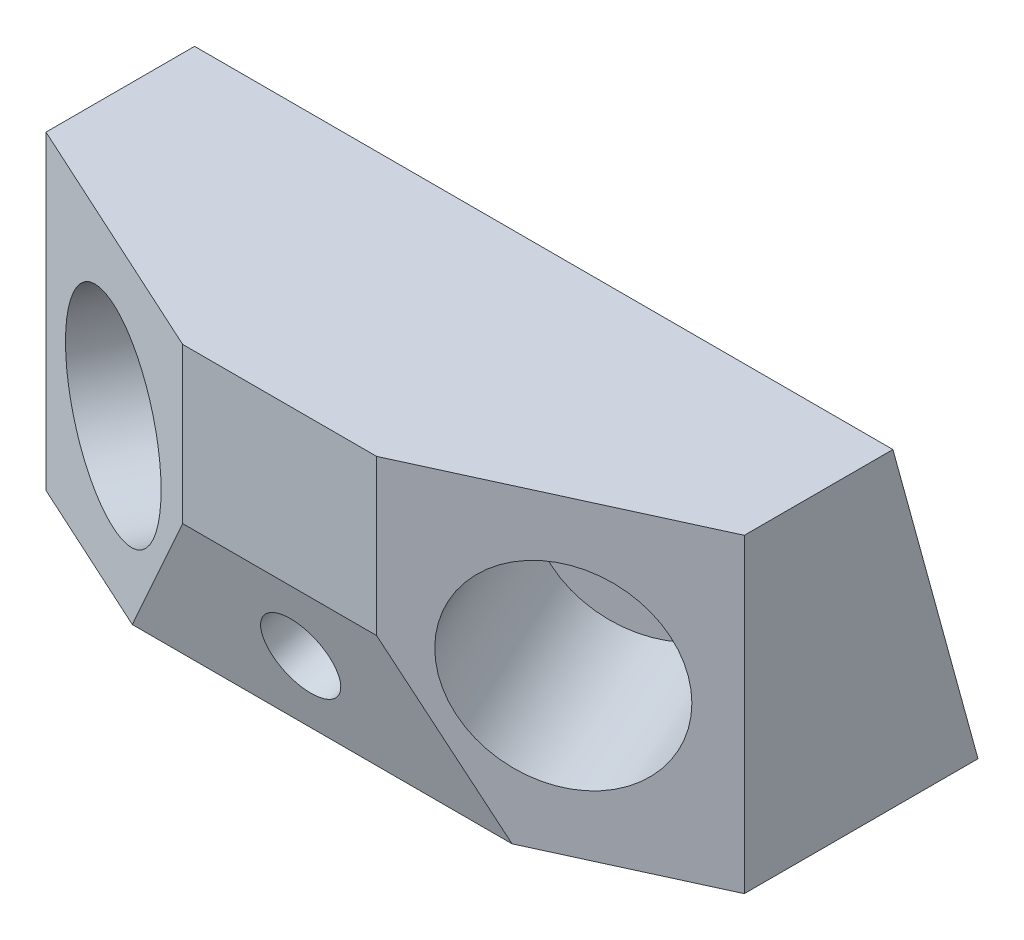
ISO-10303-21;
HEADER;
FILE_DESCRIPTION(('STEP AP214'),'2;1');
FILE_NAME('part.step','',(''),(''),'','','');
FILE_SCHEMA(('AUTOMOTIVE_DESIGN { 1 0 10303 214 1 1 1 1 }'));
ENDSEC;
DATA;
#1=APPLICATION_CONTEXT('core data for automotive mechanical design processes');
#2=APPLICATION_PROTOCOL_DEFINITION('international standard','automotive_design',2000,#1);
#3=PRODUCT_CONTEXT('',#1,'mechanical');
#4=PRODUCT('Part','Part','',(#3));
#5=PRODUCT_RELATED_PRODUCT_CATEGORY('part','',(#4));
#6=PRODUCT_DEFINITION_FORMATION('','',#4);
#7=PRODUCT_DEFINITION_CONTEXT('part definition',#1,'design');
#8=PRODUCT_DEFINITION('design','',#6,#7);
#9=PRODUCT_DEFINITION_SHAPE('','',#8);
#10=(LENGTH_UNIT() NAMED_UNIT(*) SI_UNIT(.MILLI.,.METRE.));
#11=(NAMED_UNIT(*) PLANE_ANGLE_UNIT() SI_UNIT($,.RADIAN.));
#12=(NAMED_UNIT(*) SI_UNIT($,.STERADIAN.) SOLID_ANGLE_UNIT());
#13=UNCERTAINTY_MEASURE_WITH_UNIT(LENGTH_MEASURE(1.E-05),#10,'distance_accuracy_value','');
#14=(GEOMETRIC_REPRESENTATION_CONTEXT(3) GLOBAL_UNCERTAINTY_ASSIGNED_CONTEXT((#13)) GLOBAL_UNIT_ASSIGNED_CONTEXT((#10,
#11,#12)) REPRESENTATION_CONTEXT('',''));
#15=CARTESIAN_POINT('',(0.,0.,0.));
#16=DIRECTION('',(0.,0.,1.));
#17=DIRECTION('',(1.,0.,0.));
#18=AXIS2_PLACEMENT_3D('',#15,#16,#17);
#19=CARTESIAN_POINT('',(-45.,20.,45.));
#20=DIRECTION('',(0.,-1.,0.));
#21=DIRECTION('',(0.,0.,-1.));
#22=AXIS2_PLACEMENT_3D('',#19,#20,#21);
#23=PLANE('',#22);
#24=DIRECTION('',(0.,0.,-1.));
#25=VECTOR('',#24,1.);
#26=CARTESIAN_POINT('',(45.,20.,45.));
#27=LINE('',#26,#25);
#28=CARTESIAN_POINT('',(45.,20.,30.1134763918329));
#29=VERTEX_POINT('',#28);
#30=CARTESIAN_POINT('',(45.,20.,10.9652763471162));
#31=VERTEX_POINT('',#30);
#32=EDGE_CURVE('E140',#29,#31,#27,.T.);
#33=ORIENTED_EDGE('',*,*,#32,.T.);
#34=DIRECTION('',(1.,0.,0.));
#35=VECTOR('',#34,1.);
#36=CARTESIAN_POINT('',(-61.,20.,10.9652763471162));
#37=LINE('',#36,#35);
#38=CARTESIAN_POINT('',(-45.,20.,10.9652763471162));
#39=VERTEX_POINT('',#38);
#40=EDGE_CURVE('E115',#39,#31,#37,.T.);
#41=ORIENTED_EDGE('',*,*,#40,.F.);
#42=DIRECTION('',(0.,0.,-1.));
#43=VECTOR('',#42,1.);
#44=CARTESIAN_POINT('',(-45.,20.,45.));
#45=LINE('',#44,#43);
#46=CARTESIAN_POINT('',(-45.,20.,30.1134763918332));
#47=VERTEX_POINT('',#46);
#48=EDGE_CURVE('E137',#47,#39,#45,.T.);
#49=ORIENTED_EDGE('',*,*,#48,.F.);
#50=DIRECTION('',(-0.909163440494605,0.,-0.41643947755708));
#51=VECTOR('',#50,1.);
#52=CARTESIAN_POINT('',(-39.3637902497896,20.,32.695124684359));
#53=LINE('',#52,#51);
#54=CARTESIAN_POINT('',(-12.5,20.,45.));
#55=VERTEX_POINT('',#54);
#56=EDGE_CURVE('E112',#55,#47,#53,.T.);
#57=ORIENTED_EDGE('',*,*,#56,.F.);
#58=DIRECTION('',(-1.,0.,0.));
#59=VECTOR('',#58,1.);
#60=CARTESIAN_POINT('',(-45.,20.,45.));
#61=LINE('',#60,#59);
#62=CARTESIAN_POINT('',(12.5,20.,45.));
#63=VERTEX_POINT('',#62);
#64=EDGE_CURVE('E128',#63,#55,#61,.T.);
#65=ORIENTED_EDGE('',*,*,#64,.F.);
#66=DIRECTION('',(0.909163440494602,0.,-0.416439477557086));
#67=VECTOR('',#66,1.);
#68=CARTESIAN_POINT('',(-35.0282442880889,20.,66.7701640199806));
#69=LINE('',#68,#67);
#70=EDGE_CURVE('E124',#63,#29,#69,.T.);
#71=ORIENTED_EDGE('',*,*,#70,.T.);
#72=EDGE_LOOP('',(#33,#41,#49,#57,#65,#71));
#73=FACE_BOUND('',#72,.T.);
#74=ADVANCED_FACE('F33',(#73),#23,.F.);
#75=CARTESIAN_POINT('',(-45.,-20.,45.));
#76=DIRECTION('',(1.,0.,0.));
#77=DIRECTION('',(0.,0.,-1.));
#78=AXIS2_PLACEMENT_3D('',#75,#76,#77);
#79=PLANE('',#78);
#80=ORIENTED_EDGE('',*,*,#48,.T.);
#81=DIRECTION('',(0.,-0.964419122638794,-0.264378054854443));
#82=VECTOR('',#81,1.);
#83=CARTESIAN_POINT('',(-45.,-8.52629367315474,3.14530901498783));
#84=LINE('',#83,#82);
#85=CARTESIAN_POINT('',(-45.,-20.,0.));
#86=VERTEX_POINT('',#85);
#87=EDGE_CURVE('E110',#39,#86,#84,.T.);
#88=ORIENTED_EDGE('',*,*,#87,.T.);
#89=DIRECTION('',(0.,0.,-1.));
#90=VECTOR('',#89,1.);
#91=CARTESIAN_POINT('',(-45.,-20.,45.));
#92=LINE('',#91,#90);
#93=CARTESIAN_POINT('',(-45.,-20.,30.1134763918332));
#94=VERTEX_POINT('',#93);
#95=EDGE_CURVE('E135',#94,#86,#92,.T.);
#96=ORIENTED_EDGE('',*,*,#95,.F.);
#97=DIRECTION('',(0.,-1.,0.));
#98=VECTOR('',#97,1.);
#99=CARTESIAN_POINT('',(-45.,25.,30.1134763918332));
#100=LINE('',#99,#98);
#101=EDGE_CURVE('E108',#47,#94,#100,.T.);
#102=ORIENTED_EDGE('',*,*,#101,.F.);
#103=EDGE_LOOP('',(#80,#88,#96,#102));
#104=FACE_BOUND('',#103,.T.);
#105=ADVANCED_FACE('F157',(#104),#79,.F.);
#106=CARTESIAN_POINT('',(-45.,-20.,45.));
#107=DIRECTION('',(0.,1.,0.));
#108=DIRECTION('',(0.,0.,1.));
#109=AXIS2_PLACEMENT_3D('',#106,#107,#108);
#110=PLANE('',#109);
#111=DIRECTION('',(0.909163440494602,0.,-0.416439477557086));
#112=VECTOR('',#111,1.);
#113=CARTESIAN_POINT('',(19.2052926486611,-20.,41.9286616211088));
#114=LINE('',#113,#112);
#115=CARTESIAN_POINT('',(24.4696005145808,-20.,39.5173618264419));
#116=VERTEX_POINT('',#115);
#117=CARTESIAN_POINT('',(45.,-20.,30.1134763918329));
#118=VERTEX_POINT('',#117);
#119=EDGE_CURVE('E103',#116,#118,#114,.T.);
#120=ORIENTED_EDGE('',*,*,#119,.F.);
#121=DIRECTION('',(1.,0.,0.));
#122=VECTOR('',#121,1.);
#123=CARTESIAN_POINT('',(-61.,-20.,39.5173618264419));
#124=LINE('',#123,#122);
#125=CARTESIAN_POINT('',(-24.4696005145812,-20.,39.5173618264419));
#126=VERTEX_POINT('',#125);
#127=EDGE_CURVE('E91',#126,#116,#124,.T.);
#128=ORIENTED_EDGE('',*,*,#127,.F.);
#129=DIRECTION('',(-0.909163440494605,0.,-0.41643947755708));
#130=VECTOR('',#129,1.);
#131=CARTESIAN_POINT('',(-19.2052926486608,-20.,41.928661621109));
#132=LINE('',#131,#130);
#133=EDGE_CURVE('E100',#126,#94,#132,.T.);
#134=ORIENTED_EDGE('',*,*,#133,.T.);
#135=ORIENTED_EDGE('',*,*,#95,.T.);
#136=DIRECTION('',(1.,0.,0.));
#137=VECTOR('',#136,1.);
#138=CARTESIAN_POINT('',(-45.,-20.,0.));
#139=LINE('',#138,#137);
#140=CARTESIAN_POINT('',(45.,-20.,0.));
#141=VERTEX_POINT('',#140);
#142=EDGE_CURVE('E127',#86,#141,#139,.T.);
#143=ORIENTED_EDGE('',*,*,#142,.T.);
#144=DIRECTION('',(0.,0.,-1.));
#145=VECTOR('',#144,1.);
#146=CARTESIAN_POINT('',(45.,-20.,45.));
#147=LINE('',#146,#145);
#148=EDGE_CURVE('E130',#118,#141,#147,.T.);
#149=ORIENTED_EDGE('',*,*,#148,.F.);
#150=EDGE_LOOP('',(#120,#128,#134,#135,#143,#149));
#151=FACE_BOUND('',#150,.T.);
#152=ADVANCED_FACE('F98',(#151),#110,.F.);
#153=CARTESIAN_POINT('',(0.,0.,45.));
#154=DIRECTION('',(0.,0.,-1.));
#155=DIRECTION('',(-1.,0.,0.));
#156=AXIS2_PLACEMENT_3D('',#153,#154,#155);
#157=PLANE('',#156);
#158=DIRECTION('',(0.,1.,0.));
#159=VECTOR('',#158,1.);
#160=CARTESIAN_POINT('',(-12.5,0.,45.));
#161=LINE('',#160,#159);
#162=CARTESIAN_POINT('',(-12.5,0.,45.));
#163=VERTEX_POINT('',#162);
#164=EDGE_CURVE('E41',#163,#55,#161,.T.);
#165=ORIENTED_EDGE('',*,*,#164,.F.);
#166=DIRECTION('',(1.,0.,0.));
#167=VECTOR('',#166,1.);
#168=CARTESIAN_POINT('',(-61.,0.,45.));
#169=LINE('',#168,#167);
#170=CARTESIAN_POINT('',(12.5,0.,45.));
#171=VERTEX_POINT('',#170);
#172=EDGE_CURVE('E47',#163,#171,#169,.T.);
#173=ORIENTED_EDGE('',*,*,#172,.T.);
#174=DIRECTION('',(0.,1.,0.));
#175=VECTOR('',#174,1.);
#176=CARTESIAN_POINT('',(12.5,0.,45.));
#177=LINE('',#176,#175);
#178=EDGE_CURVE('E54',#171,#63,#177,.T.);
#179=ORIENTED_EDGE('',*,*,#178,.T.);
#180=ORIENTED_EDGE('',*,*,#64,.T.);
#181=EDGE_LOOP('',(#165,#173,#179,#180));
#182=FACE_BOUND('',#181,.T.);
#183=ADVANCED_FACE('F148',(#182),#157,.F.);
#184=CARTESIAN_POINT('',(45.,-20.,45.));
#185=DIRECTION('',(-1.,0.,0.));
#186=DIRECTION('',(0.,0.,1.));
#187=AXIS2_PLACEMENT_3D('',#184,#185,#186);
#188=PLANE('',#187);
#189=ORIENTED_EDGE('',*,*,#148,.T.);
#190=DIRECTION('',(0.,-0.964419122638794,-0.264378054854442));
#191=VECTOR('',#190,1.);
#192=CARTESIAN_POINT('',(45.,-20.,0.));
#193=LINE('',#192,#191);
#194=EDGE_CURVE('E171',#31,#141,#193,.T.);
#195=ORIENTED_EDGE('',*,*,#194,.F.);
#196=ORIENTED_EDGE('',*,*,#32,.F.);
#197=DIRECTION('',(0.,-1.,0.));
#198=VECTOR('',#197,1.);
#199=CARTESIAN_POINT('',(45.,25.,30.1134763918329));
#200=LINE('',#199,#198);
#201=EDGE_CURVE('E121',#29,#118,#200,.T.);
#202=ORIENTED_EDGE('',*,*,#201,.T.);
#203=EDGE_LOOP('',(#189,#195,#196,#202));
#204=FACE_BOUND('',#203,.T.);
#205=ADVANCED_FACE('F35',(#204),#188,.F.);
#206=CARTESIAN_POINT('',(19.2052926486611,25.,41.9286616211088));
#207=DIRECTION('',(-0.416439477557086,0.,-0.909163440494602));
#208=DIRECTION('',(-0.909163440494602,0.,0.416439477557086));
#209=AXIS2_PLACEMENT_3D('',#206,#207,#208);
#210=PLANE('',#209);
#211=CARTESIAN_POINT('',(28.998723447295,0.,37.4428111968376));
#212=DIRECTION('',(0.416439477557086,0.,0.909163440494602));
#213=DIRECTION('',(0.909163440494602,0.,-0.416439477557086));
#214=AXIS2_PLACEMENT_3D('',#211,#212,#213);
#215=CIRCLE('',#214,12.5);
#216=CARTESIAN_POINT('',(40.3632664534776,0.,32.2373177273741));
#217=VERTEX_POINT('',#216);
#218=EDGE_CURVE('E179',#217,#217,#215,.T.);
#219=ORIENTED_EDGE('',*,*,#218,.F.);
#220=EDGE_LOOP('',(#219));
#221=FACE_BOUND('',#220,.T.);
#222=ORIENTED_EDGE('',*,*,#178,.F.);
#223=DIRECTION('',(0.49989302065529,-0.835271018521193,-0.228974438570552));
#224=VECTOR('',#223,1.);
#225=CARTESIAN_POINT('',(4.08850585463684,14.0547617025591,48.8528586515356));
#226=LINE('',#225,#224);
#227=EDGE_CURVE('E173',#171,#116,#226,.T.);
#228=ORIENTED_EDGE('',*,*,#227,.T.);
#229=ORIENTED_EDGE('',*,*,#119,.T.);
#230=ORIENTED_EDGE('',*,*,#201,.F.);
#231=ORIENTED_EDGE('',*,*,#70,.F.);
#232=EDGE_LOOP('',(#222,#228,#229,#230,#231));
#233=FACE_BOUND('',#232,.T.);
#234=ADVANCED_FACE('F155',(#221,#233),#210,.F.);
#235=CARTESIAN_POINT('',(-19.2052926486608,25.,41.928661621109));
#236=DIRECTION('',(-0.41643947755708,0.,0.909163440494605));
#237=DIRECTION('',(0.909163440494605,0.,0.41643947755708));
#238=AXIS2_PLACEMENT_3D('',#235,#236,#237);
#239=PLANE('',#238);
#240=CARTESIAN_POINT('',(-28.998723447295,0.,37.4428111968376));
#241=DIRECTION('',(0.416439477557086,0.,-0.909163440494602));
#242=DIRECTION('',(-0.909163440494602,0.,-0.416439477557086));
#243=AXIS2_PLACEMENT_3D('',#240,#241,#242);
#244=CIRCLE('',#243,12.5);
#245=CARTESIAN_POINT('',(-40.3632664534776,0.,32.2373177273741));
#246=VERTEX_POINT('',#245);
#247=EDGE_CURVE('E185',#246,#246,#244,.T.);
#248=ORIENTED_EDGE('',*,*,#247,.T.);
#249=EDGE_LOOP('',(#248));
#250=FACE_BOUND('',#249,.T.);
#251=DIRECTION('',(-0.499893020655297,-0.835271018521189,-0.228974438570551));
#252=VECTOR('',#251,1.);
#253=CARTESIAN_POINT('',(-4.08850585463671,14.0547617025591,48.8528586515356));
#254=LINE('',#253,#252);
#255=EDGE_CURVE('E11',#163,#126,#254,.T.);
#256=ORIENTED_EDGE('',*,*,#255,.F.);
#257=ORIENTED_EDGE('',*,*,#164,.T.);
#258=ORIENTED_EDGE('',*,*,#56,.T.);
#259=ORIENTED_EDGE('',*,*,#101,.T.);
#260=ORIENTED_EDGE('',*,*,#133,.F.);
#261=EDGE_LOOP('',(#256,#257,#258,#259,#260));
#262=FACE_BOUND('',#261,.T.);
#263=ADVANCED_FACE('F106',(#250,#262),#239,.T.);
#264=CARTESIAN_POINT('',(-61.,-20.,0.));
#265=DIRECTION('',(0.,-0.264378054854443,0.964419122638794));
#266=DIRECTION('',(0.,-0.964419122638794,-0.264378054854443));
#267=AXIS2_PLACEMENT_3D('',#264,#265,#266);
#268=PLANE('',#267);
#269=CARTESIAN_POINT('',(35.,0.359452438720388,5.58117555666343));
#270=DIRECTION('',(0.,0.264378054854443,-0.964419122638794));
#271=DIRECTION('',(0.,0.964419122638794,0.264378054854443));
#272=AXIS2_PLACEMENT_3D('',#269,#270,#271);
#273=CIRCLE('',#272,2.);
#274=CARTESIAN_POINT('',(35.,2.28829068399798,6.10993166637232));
#275=VERTEX_POINT('',#274);
#276=EDGE_CURVE('E203',#275,#275,#273,.T.);
#277=ORIENTED_EDGE('',*,*,#276,.F.);
#278=EDGE_LOOP('',(#277));
#279=FACE_BOUND('',#278,.T.);
#280=CARTESIAN_POINT('',(-35.,0.0449315548400526,5.49495534644626));
#281=DIRECTION('',(0.,0.264378054854443,-0.964419122638794));
#282=DIRECTION('',(0.,0.964419122638794,0.264378054854443));
#283=AXIS2_PLACEMENT_3D('',#280,#281,#282);
#284=CIRCLE('',#283,2.);
#285=CARTESIAN_POINT('',(-35.,1.97376980011764,6.02371145615514));
#286=VERTEX_POINT('',#285);
#287=EDGE_CURVE('E197',#286,#286,#284,.T.);
#288=ORIENTED_EDGE('',*,*,#287,.F.);
#289=EDGE_LOOP('',(#288));
#290=FACE_BOUND('',#289,.T.);
#291=CARTESIAN_POINT('',(0.,0.202191996780226,5.53806545155484));
#292=DIRECTION('',(0.,-0.264378054854443,0.964419122638794));
#293=DIRECTION('',(0.,-0.964419122638794,-0.264378054854443));
#294=AXIS2_PLACEMENT_3D('',#291,#292,#293);
#295=CIRCLE('',#294,5.);
#296=CARTESIAN_POINT('',(0.,-4.61990361641375,4.21617517728263));
#297=VERTEX_POINT('',#296);
#298=EDGE_CURVE('E188',#297,#297,#295,.T.);
#299=ORIENTED_EDGE('',*,*,#298,.T.);
#300=EDGE_LOOP('',(#299));
#301=FACE_BOUND('',#300,.T.);
#302=ORIENTED_EDGE('',*,*,#40,.T.);
#303=ORIENTED_EDGE('',*,*,#194,.T.);
#304=ORIENTED_EDGE('',*,*,#142,.F.);
#305=ORIENTED_EDGE('',*,*,#87,.F.);
#306=EDGE_LOOP('',(#302,#303,#304,#305));
#307=FACE_BOUND('',#306,.T.);
#308=ADVANCED_FACE('F169',(#279,#290,#301,#307),#268,.F.);
#309=CARTESIAN_POINT('',(-61.,0.,45.));
#310=DIRECTION('',(0.,0.264378054854442,-0.964419122638794));
#311=DIRECTION('',(0.,0.964419122638794,0.264378054854442));
#312=AXIS2_PLACEMENT_3D('',#309,#310,#311);
#313=PLANE('',#312);
#314=CARTESIAN_POINT('',(0.,-9.87359921229266,42.2933314024136));
#315=DIRECTION('',(0.,-0.264378054854442,0.964419122638794));
#316=DIRECTION('',(0.,-0.964419122638794,-0.264378054854442));
#317=AXIS2_PLACEMENT_3D('',#314,#315,#316);
#318=CIRCLE('',#317,5.);
#319=CARTESIAN_POINT('',(0.,-14.6956948254866,40.9714411281414));
#320=VERTEX_POINT('',#319);
#321=EDGE_CURVE('E193',#320,#320,#318,.T.);
#322=ORIENTED_EDGE('',*,*,#321,.F.);
#323=EDGE_LOOP('',(#322));
#324=FACE_BOUND('',#323,.T.);
#325=ORIENTED_EDGE('',*,*,#172,.F.);
#326=ORIENTED_EDGE('',*,*,#255,.T.);
#327=ORIENTED_EDGE('',*,*,#127,.T.);
#328=ORIENTED_EDGE('',*,*,#227,.F.);
#329=EDGE_LOOP('',(#325,#326,#327,#328));
#330=FACE_BOUND('',#329,.T.);
#331=ADVANCED_FACE('F90',(#324,#330),#313,.F.);
#332=CARTESIAN_POINT('',(18.5877365083679,0.,14.7137251844726));
#333=DIRECTION('',(0.416439477557086,0.,0.909163440494602));
#334=DIRECTION('',(0.909163440494602,0.,-0.416439477557086));
#335=AXIS2_PLACEMENT_3D('',#332,#333,#334);
#336=CYLINDRICAL_SURFACE('',#335,12.5);
#337=CARTESIAN_POINT('',(18.5877365083679,0.,14.7137251844726));
#338=DIRECTION('',(0.416439477557086,0.,0.909163440494602));
#339=DIRECTION('',(0.909163440494602,0.,-0.416439477557086));
#340=AXIS2_PLACEMENT_3D('',#337,#338,#339);
#341=CIRCLE('',#340,12.5);
#342=CARTESIAN_POINT('',(29.9522795145504,0.,9.50823171500902));
#343=VERTEX_POINT('',#342);
#344=EDGE_CURVE('E104',#343,#343,#341,.T.);
#345=ORIENTED_EDGE('',*,*,#344,.F.);
#346=EDGE_LOOP('',(#345));
#347=FACE_BOUND('',#346,.T.);
#348=ORIENTED_EDGE('',*,*,#218,.T.);
#349=EDGE_LOOP('',(#348));
#350=FACE_BOUND('',#349,.T.);
#351=ADVANCED_FACE('F248',(#347,#350),#336,.F.);
#352=CARTESIAN_POINT('',(18.5877365083679,0.,14.7137251844726));
#353=DIRECTION('',(0.416439477557086,0.,0.909163440494602));
#354=DIRECTION('',(0.909163440494602,0.,-0.416439477557086));
#355=AXIS2_PLACEMENT_3D('',#352,#353,#354);
#356=PLANE('',#355);
#357=ORIENTED_EDGE('',*,*,#344,.T.);
#358=EDGE_LOOP('',(#357));
#359=FACE_BOUND('',#358,.T.);
#360=ADVANCED_FACE('F244',(#359),#356,.T.);
#361=CARTESIAN_POINT('',(-18.5877365083679,0.,14.7137251844726));
#362=DIRECTION('',(-0.416439477557086,0.,0.909163440494602));
#363=DIRECTION('',(0.909163440494602,0.,0.416439477557086));
#364=AXIS2_PLACEMENT_3D('',#361,#362,#363);
#365=CYLINDRICAL_SURFACE('',#364,12.5);
#366=CARTESIAN_POINT('',(-18.5877365083679,0.,14.7137251844726));
#367=DIRECTION('',(0.416439477557086,0.,-0.909163440494602));
#368=DIRECTION('',(-0.909163440494602,0.,-0.416439477557086));
#369=AXIS2_PLACEMENT_3D('',#366,#367,#368);
#370=CIRCLE('',#369,12.5);
#371=CARTESIAN_POINT('',(-29.9522795145504,0.,9.50823171500902));
#372=VERTEX_POINT('',#371);
#373=EDGE_CURVE('E182',#372,#372,#370,.T.);
#374=ORIENTED_EDGE('',*,*,#373,.T.);
#375=EDGE_LOOP('',(#374));
#376=FACE_BOUND('',#375,.T.);
#377=ORIENTED_EDGE('',*,*,#247,.F.);
#378=EDGE_LOOP('',(#377));
#379=FACE_BOUND('',#378,.T.);
#380=ADVANCED_FACE('F237',(#376,#379),#365,.F.);
#381=CARTESIAN_POINT('',(-18.5877365083679,0.,14.7137251844726));
#382=DIRECTION('',(-0.416439477557086,0.,0.909163440494602));
#383=DIRECTION('',(-0.909163440494602,0.,-0.416439477557086));
#384=AXIS2_PLACEMENT_3D('',#381,#382,#383);
#385=PLANE('',#384);
#386=ORIENTED_EDGE('',*,*,#373,.F.);
#387=EDGE_LOOP('',(#386));
#388=FACE_BOUND('',#387,.T.);
#389=ADVANCED_FACE('F228',(#388),#385,.T.);
#390=CARTESIAN_POINT('',(0.,4.93157185955612,-11.7141394653589));
#391=DIRECTION('',(0.,-0.264378054854442,0.964419122638794));
#392=DIRECTION('',(0.,-0.964419122638794,-0.264378054854442));
#393=AXIS2_PLACEMENT_3D('',#390,#391,#392);
#394=CYLINDRICAL_SURFACE('',#393,5.);
#395=ORIENTED_EDGE('',*,*,#321,.T.);
#396=EDGE_LOOP('',(#395));
#397=FACE_BOUND('',#396,.T.);
#398=ORIENTED_EDGE('',*,*,#298,.F.);
#399=EDGE_LOOP('',(#398));
#400=FACE_BOUND('',#399,.T.);
#401=ADVANCED_FACE('F225',(#397,#400),#394,.F.);
#402=CARTESIAN_POINT('',(-35.,-2.86322704855882,16.103565695473));
#403=DIRECTION('',(0.,0.264378054854443,-0.964419122638794));
#404=DIRECTION('',(0.,0.964419122638794,0.264378054854443));
#405=AXIS2_PLACEMENT_3D('',#402,#403,#404);
#406=CYLINDRICAL_SURFACE('',#405,2.);
#407=CARTESIAN_POINT('',(-35.,-2.86322704855882,16.103565695473));
#408=DIRECTION('',(0.,0.264378054854443,-0.964419122638794));
#409=DIRECTION('',(0.,0.964419122638794,0.264378054854443));
#410=AXIS2_PLACEMENT_3D('',#407,#408,#409);
#411=CIRCLE('',#410,2.);
#412=CARTESIAN_POINT('',(-35.,-0.934388803281225,16.6323218051819));
#413=VERTEX_POINT('',#412);
#414=EDGE_CURVE('E196',#413,#413,#411,.T.);
#415=ORIENTED_EDGE('',*,*,#414,.F.);
#416=EDGE_LOOP('',(#415));
#417=FACE_BOUND('',#416,.T.);
#418=ORIENTED_EDGE('',*,*,#287,.T.);
#419=EDGE_LOOP('',(#418));
#420=FACE_BOUND('',#419,.T.);
#421=ADVANCED_FACE('F227',(#417,#420),#406,.F.);
#422=CARTESIAN_POINT('',(-35.,-2.86322704855882,16.103565695473));
#423=DIRECTION('',(0.,0.264378054854443,-0.964419122638794));
#424=DIRECTION('',(0.,0.964419122638794,0.264378054854443));
#425=AXIS2_PLACEMENT_3D('',#422,#423,#424);
#426=PLANE('',#425);
#427=ORIENTED_EDGE('',*,*,#414,.T.);
#428=EDGE_LOOP('',(#427));
#429=FACE_BOUND('',#428,.T.);
#430=ADVANCED_FACE('F214',(#429),#426,.T.);
#431=CARTESIAN_POINT('',(35.,-2.54870616467848,16.1897859056902));
#432=DIRECTION('',(0.,0.264378054854443,-0.964419122638794));
#433=DIRECTION('',(0.,0.964419122638794,0.264378054854443));
#434=AXIS2_PLACEMENT_3D('',#431,#432,#433);
#435=CYLINDRICAL_SURFACE('',#434,2.);
#436=CARTESIAN_POINT('',(35.,-2.54870616467848,16.1897859056902));
#437=DIRECTION('',(0.,0.264378054854443,-0.964419122638794));
#438=DIRECTION('',(0.,0.964419122638794,0.264378054854443));
#439=AXIS2_PLACEMENT_3D('',#436,#437,#438);
#440=CIRCLE('',#439,2.);
#441=CARTESIAN_POINT('',(35.,-0.619867919400889,16.7185420153991));
#442=VERTEX_POINT('',#441);
#443=EDGE_CURVE('E200',#442,#442,#440,.T.);
#444=ORIENTED_EDGE('',*,*,#443,.F.);
#445=EDGE_LOOP('',(#444));
#446=FACE_BOUND('',#445,.T.);
#447=ORIENTED_EDGE('',*,*,#276,.T.);
#448=EDGE_LOOP('',(#447));
#449=FACE_BOUND('',#448,.T.);
#450=ADVANCED_FACE('F211',(#446,#449),#435,.F.);
#451=CARTESIAN_POINT('',(35.,-2.54870616467848,16.1897859056902));
#452=DIRECTION('',(0.,0.264378054854443,-0.964419122638794));
#453=DIRECTION('',(0.,0.964419122638794,0.264378054854443));
#454=AXIS2_PLACEMENT_3D('',#451,#452,#453);
#455=PLANE('',#454);
#456=ORIENTED_EDGE('',*,*,#443,.T.);
#457=EDGE_LOOP('',(#456));
#458=FACE_BOUND('',#457,.T.);
#459=ADVANCED_FACE('F209',(#458),#455,.T.);
#460=CLOSED_SHELL('',(#74,#105,#152,#183,#205,#234,#263,#308,#331,#351,#360,#380,#389,#401,#421,
#430,#450,#459));
#461=MANIFOLD_SOLID_BREP('B2',#460);
#462=ADVANCED_BREP_SHAPE_REPRESENTATION('',(#18,#461),#14);
#463=SHAPE_DEFINITION_REPRESENTATION(#9,#462);
ENDSEC;
END-ISO-10303-21;
